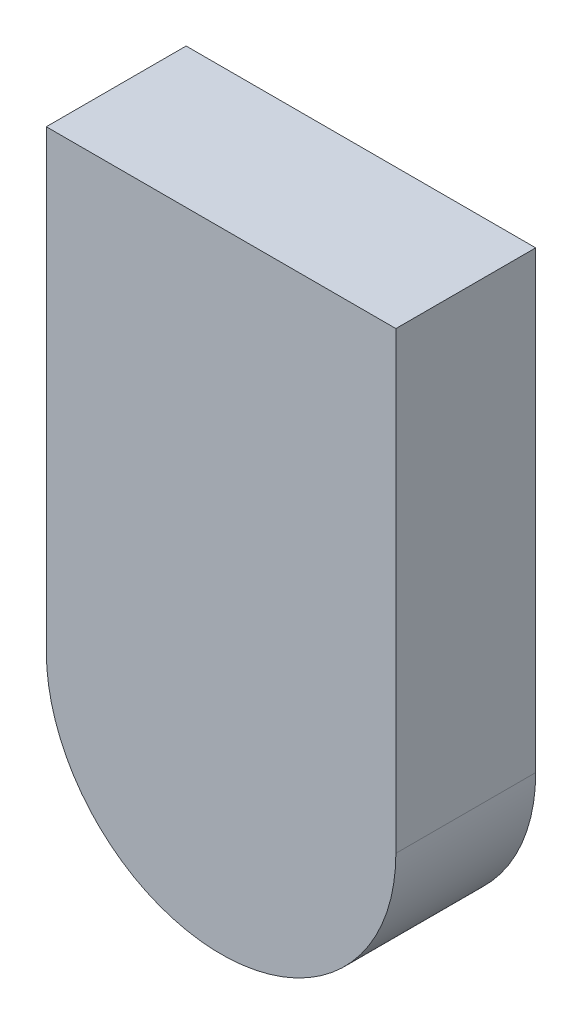
ISO-10303-21;
HEADER;
FILE_DESCRIPTION(('STEP AP214'),'2;1');
FILE_NAME('part.step','',(''),(''),'','','');
FILE_SCHEMA(('AUTOMOTIVE_DESIGN { 1 0 10303 214 1 1 1 1 }'));
ENDSEC;
DATA;
#1=APPLICATION_CONTEXT('core data for automotive mechanical design processes');
#2=APPLICATION_PROTOCOL_DEFINITION('international standard','automotive_design',2000,#1);
#3=PRODUCT_CONTEXT('',#1,'mechanical');
#4=PRODUCT('Part','Part','',(#3));
#5=PRODUCT_RELATED_PRODUCT_CATEGORY('part','',(#4));
#6=PRODUCT_DEFINITION_FORMATION('','',#4);
#7=PRODUCT_DEFINITION_CONTEXT('part definition',#1,'design');
#8=PRODUCT_DEFINITION('design','',#6,#7);
#9=PRODUCT_DEFINITION_SHAPE('','',#8);
#10=(LENGTH_UNIT() NAMED_UNIT(*) SI_UNIT(.MILLI.,.METRE.));
#11=(NAMED_UNIT(*) PLANE_ANGLE_UNIT() SI_UNIT($,.RADIAN.));
#12=(NAMED_UNIT(*) SI_UNIT($,.STERADIAN.) SOLID_ANGLE_UNIT());
#13=UNCERTAINTY_MEASURE_WITH_UNIT(LENGTH_MEASURE(1.E-05),#10,'distance_accuracy_value','');
#14=(GEOMETRIC_REPRESENTATION_CONTEXT(3) GLOBAL_UNCERTAINTY_ASSIGNED_CONTEXT((#13)) GLOBAL_UNIT_ASSIGNED_CONTEXT((#10,
#11,#12)) REPRESENTATION_CONTEXT('',''));
#15=CARTESIAN_POINT('',(0.,0.,0.));
#16=DIRECTION('',(0.,0.,1.));
#17=DIRECTION('',(1.,0.,0.));
#18=AXIS2_PLACEMENT_3D('',#15,#16,#17);
#19=CARTESIAN_POINT('',(-1.375,2.05,0.));
#20=DIRECTION('',(0.,1.,0.));
#21=DIRECTION('',(1.,0.,0.));
#22=AXIS2_PLACEMENT_3D('',#19,#20,#21);
#23=PLANE('',#22);
#24=DIRECTION('',(0.,0.,1.));
#25=VECTOR('',#24,1.);
#26=CARTESIAN_POINT('',(-1.375,2.05,0.));
#27=LINE('',#26,#25);
#28=CARTESIAN_POINT('',(-1.375,2.05,0.));
#29=VERTEX_POINT('',#28);
#30=CARTESIAN_POINT('',(-1.375,2.05,0.1));
#31=VERTEX_POINT('',#30);
#32=EDGE_CURVE('E11',#29,#31,#27,.T.);
#33=ORIENTED_EDGE('',*,*,#32,.T.);
#34=DIRECTION('',(1.,0.,0.));
#35=VECTOR('',#34,1.);
#36=CARTESIAN_POINT('',(-1.375,2.05,0.1));
#37=LINE('',#36,#35);
#38=CARTESIAN_POINT('',(-1.125,2.05,0.1));
#39=VERTEX_POINT('',#38);
#40=EDGE_CURVE('E24',#31,#39,#37,.T.);
#41=ORIENTED_EDGE('',*,*,#40,.T.);
#42=DIRECTION('',(0.,0.,1.));
#43=VECTOR('',#42,1.);
#44=CARTESIAN_POINT('',(-1.125,2.05,0.));
#45=LINE('',#44,#43);
#46=CARTESIAN_POINT('',(-1.125,2.05,0.));
#47=VERTEX_POINT('',#46);
#48=EDGE_CURVE('E85',#47,#39,#45,.T.);
#49=ORIENTED_EDGE('',*,*,#48,.F.);
#50=DIRECTION('',(1.,0.,0.));
#51=VECTOR('',#50,1.);
#52=CARTESIAN_POINT('',(-1.375,2.05,0.));
#53=LINE('',#52,#51);
#54=EDGE_CURVE('E82',#29,#47,#53,.T.);
#55=ORIENTED_EDGE('',*,*,#54,.F.);
#56=EDGE_LOOP('',(#33,#41,#49,#55));
#57=FACE_BOUND('',#56,.T.);
#58=ADVANCED_FACE('F17',(#57),#23,.T.);
#59=CARTESIAN_POINT('',(-1.125,2.05,0.));
#60=DIRECTION('',(1.,0.,0.));
#61=DIRECTION('',(0.,-1.,0.));
#62=AXIS2_PLACEMENT_3D('',#59,#60,#61);
#63=PLANE('',#62);
#64=ORIENTED_EDGE('',*,*,#48,.T.);
#65=DIRECTION('',(0.,-1.,0.));
#66=VECTOR('',#65,1.);
#67=CARTESIAN_POINT('',(-1.125,2.05,0.1));
#68=LINE('',#67,#66);
#69=CARTESIAN_POINT('',(-1.125,1.725,0.1));
#70=VERTEX_POINT('',#69);
#71=EDGE_CURVE('E80',#39,#70,#68,.T.);
#72=ORIENTED_EDGE('',*,*,#71,.T.);
#73=DIRECTION('',(0.,0.,1.));
#74=VECTOR('',#73,1.);
#75=CARTESIAN_POINT('',(-1.125,1.725,0.));
#76=LINE('',#75,#74);
#77=CARTESIAN_POINT('',(-1.125,1.725,0.));
#78=VERTEX_POINT('',#77);
#79=EDGE_CURVE('E60',#78,#70,#76,.T.);
#80=ORIENTED_EDGE('',*,*,#79,.F.);
#81=DIRECTION('',(0.,-1.,0.));
#82=VECTOR('',#81,1.);
#83=CARTESIAN_POINT('',(-1.125,2.05,0.));
#84=LINE('',#83,#82);
#85=EDGE_CURVE('E76',#47,#78,#84,.T.);
#86=ORIENTED_EDGE('',*,*,#85,.F.);
#87=EDGE_LOOP('',(#64,#72,#80,#86));
#88=FACE_BOUND('',#87,.T.);
#89=ADVANCED_FACE('F89',(#88),#63,.T.);
#90=CARTESIAN_POINT('',(-1.25,1.725,0.));
#91=DIRECTION('',(0.,0.,-1.));
#92=DIRECTION('',(1.,0.,0.));
#93=AXIS2_PLACEMENT_3D('',#90,#91,#92);
#94=CYLINDRICAL_SURFACE('',#93,0.125);
#95=CARTESIAN_POINT('',(-1.25,1.725,0.));
#96=DIRECTION('',(0.,0.,1.));
#97=DIRECTION('',(1.,0.,0.));
#98=AXIS2_PLACEMENT_3D('',#95,#96,#97);
#99=CIRCLE('',#98,0.125);
#100=CARTESIAN_POINT('',(-1.375,1.725,0.));
#101=VERTEX_POINT('',#100);
#102=EDGE_CURVE('E64',#101,#78,#99,.T.);
#103=ORIENTED_EDGE('',*,*,#102,.T.);
#104=ORIENTED_EDGE('',*,*,#79,.T.);
#105=CARTESIAN_POINT('',(-1.25,1.725,0.1));
#106=DIRECTION('',(0.,0.,1.));
#107=DIRECTION('',(1.,0.,0.));
#108=AXIS2_PLACEMENT_3D('',#105,#106,#107);
#109=CIRCLE('',#108,0.125);
#110=CARTESIAN_POINT('',(-1.375,1.725,0.1));
#111=VERTEX_POINT('',#110);
#112=EDGE_CURVE('E55',#111,#70,#109,.T.);
#113=ORIENTED_EDGE('',*,*,#112,.F.);
#114=DIRECTION('',(0.,0.,1.));
#115=VECTOR('',#114,1.);
#116=CARTESIAN_POINT('',(-1.375,1.725,0.));
#117=LINE('',#116,#115);
#118=EDGE_CURVE('E59',#101,#111,#117,.T.);
#119=ORIENTED_EDGE('',*,*,#118,.F.);
#120=EDGE_LOOP('',(#103,#104,#113,#119));
#121=FACE_BOUND('',#120,.T.);
#122=ADVANCED_FACE('F58',(#121),#94,.T.);
#123=CARTESIAN_POINT('',(-1.375,2.05,0.));
#124=DIRECTION('',(1.,0.,0.));
#125=DIRECTION('',(0.,-1.,0.));
#126=AXIS2_PLACEMENT_3D('',#123,#124,#125);
#127=PLANE('',#126);
#128=DIRECTION('',(0.,-1.,0.));
#129=VECTOR('',#128,1.);
#130=CARTESIAN_POINT('',(-1.375,2.05,0.));
#131=LINE('',#130,#129);
#132=EDGE_CURVE('E69',#29,#101,#131,.T.);
#133=ORIENTED_EDGE('',*,*,#132,.T.);
#134=ORIENTED_EDGE('',*,*,#118,.T.);
#135=DIRECTION('',(0.,-1.,0.));
#136=VECTOR('',#135,1.);
#137=CARTESIAN_POINT('',(-1.375,2.05,0.1));
#138=LINE('',#137,#136);
#139=EDGE_CURVE('E67',#31,#111,#138,.T.);
#140=ORIENTED_EDGE('',*,*,#139,.F.);
#141=ORIENTED_EDGE('',*,*,#32,.F.);
#142=EDGE_LOOP('',(#133,#134,#140,#141));
#143=FACE_BOUND('',#142,.T.);
#144=ADVANCED_FACE('F66',(#143),#127,.F.);
#145=CARTESIAN_POINT('',(-1.25,1.850342514613,0.));
#146=DIRECTION('',(0.,0.,-1.));
#147=DIRECTION('',(-1.,0.,0.));
#148=AXIS2_PLACEMENT_3D('',#145,#146,#147);
#149=PLANE('',#148);
#150=ORIENTED_EDGE('',*,*,#54,.T.);
#151=ORIENTED_EDGE('',*,*,#85,.T.);
#152=ORIENTED_EDGE('',*,*,#102,.F.);
#153=ORIENTED_EDGE('',*,*,#132,.F.);
#154=EDGE_LOOP('',(#150,#151,#152,#153));
#155=FACE_BOUND('',#154,.T.);
#156=ADVANCED_FACE('F91',(#155),#149,.T.);
#157=CARTESIAN_POINT('',(-1.25,1.850342514613,0.1));
#158=DIRECTION('',(0.,0.,-1.));
#159=DIRECTION('',(-1.,0.,0.));
#160=AXIS2_PLACEMENT_3D('',#157,#158,#159);
#161=PLANE('',#160);
#162=ORIENTED_EDGE('',*,*,#139,.T.);
#163=ORIENTED_EDGE('',*,*,#112,.T.);
#164=ORIENTED_EDGE('',*,*,#71,.F.);
#165=ORIENTED_EDGE('',*,*,#40,.F.);
#166=EDGE_LOOP('',(#162,#163,#164,#165));
#167=FACE_BOUND('',#166,.T.);
#168=ADVANCED_FACE('F71',(#167),#161,.F.);
#169=CLOSED_SHELL('',(#58,#89,#122,#144,#156,#168));
#170=MANIFOLD_SOLID_BREP('B1',#169);
#171=ADVANCED_BREP_SHAPE_REPRESENTATION('',(#18,#170),#14);
#172=SHAPE_DEFINITION_REPRESENTATION(#9,#171);
ENDSEC;
END-ISO-10303-21;
